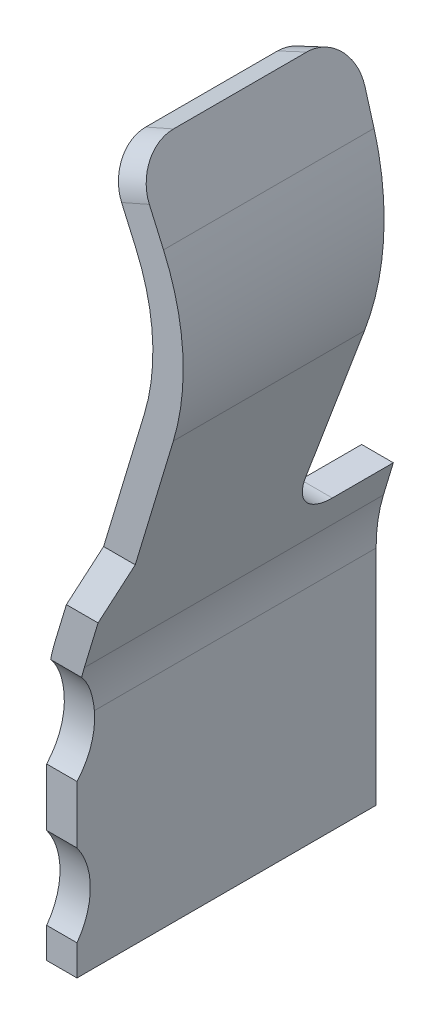
ISO-10303-21;
HEADER;
FILE_DESCRIPTION(('STEP AP214'),'2;1');
FILE_NAME('part.step','',(''),(''),'','','');
FILE_SCHEMA(('AUTOMOTIVE_DESIGN { 1 0 10303 214 1 1 1 1 }'));
ENDSEC;
DATA;
#1=APPLICATION_CONTEXT('core data for automotive mechanical design processes');
#2=APPLICATION_PROTOCOL_DEFINITION('international standard','automotive_design',2000,#1);
#3=PRODUCT_CONTEXT('',#1,'mechanical');
#4=PRODUCT('Part','Part','',(#3));
#5=PRODUCT_RELATED_PRODUCT_CATEGORY('part','',(#4));
#6=PRODUCT_DEFINITION_FORMATION('','',#4);
#7=PRODUCT_DEFINITION_CONTEXT('part definition',#1,'design');
#8=PRODUCT_DEFINITION('design','',#6,#7);
#9=PRODUCT_DEFINITION_SHAPE('','',#8);
#10=(LENGTH_UNIT() NAMED_UNIT(*) SI_UNIT(.MILLI.,.METRE.));
#11=(NAMED_UNIT(*) PLANE_ANGLE_UNIT() SI_UNIT($,.RADIAN.));
#12=(NAMED_UNIT(*) SI_UNIT($,.STERADIAN.) SOLID_ANGLE_UNIT());
#13=UNCERTAINTY_MEASURE_WITH_UNIT(LENGTH_MEASURE(1.E-05),#10,'distance_accuracy_value','');
#14=(GEOMETRIC_REPRESENTATION_CONTEXT(3) GLOBAL_UNCERTAINTY_ASSIGNED_CONTEXT((#13)) GLOBAL_UNIT_ASSIGNED_CONTEXT((#10,
#11,#12)) REPRESENTATION_CONTEXT('',''));
#15=CARTESIAN_POINT('',(0.,0.,0.));
#16=DIRECTION('',(0.,0.,1.));
#17=DIRECTION('',(1.,0.,0.));
#18=AXIS2_PLACEMENT_3D('',#15,#16,#17);
#19=CARTESIAN_POINT('',(-6.93613725867002,3.53312166947706,-0.236832722369338));
#20=DIRECTION('',(-0.914255270392899,-0.402239697454472,0.0483789866630426));
#21=DIRECTION('',(0.402711251685501,-0.915327071470027,0.));
#22=AXIS2_PLACEMENT_3D('',#19,#20,#21);
#23=CYLINDRICAL_SURFACE('',#22,0.2);
#24=CARTESIAN_POINT('',(-6.94964147732528,3.50329761180303,-0.434687053017797));
#25=CARTESIAN_POINT('',(-7.00071840447188,3.6193909515076,-0.448650066039084));
#26=CARTESIAN_POINT('',(-7.03898718351819,3.70637250294574,-0.363398989614743));
#27=CARTESIAN_POINT('',(-7.03898718351819,3.70637250294574,-0.235652283248446));
#28=(BOUNDED_CURVE() B_SPLINE_CURVE(3,(#24,#25,#26,#27),.UNSPECIFIED.,.F.,
.F.) B_SPLINE_CURVE_WITH_KNOTS((4,4),(3.0320715031167,4.71238898038462),
.UNSPECIFIED.) CURVE() GEOMETRIC_REPRESENTATION_ITEM() RATIONAL_B_SPLINE_CURVE((1.,
0.778229742533871,0.778229742533871,1.)) REPRESENTATION_ITEM(''));
#29=CARTESIAN_POINT('',(-6.94964147732528,3.50329761180303,-0.434687053017797));
#30=VERTEX_POINT('',#29);
#31=CARTESIAN_POINT('',(-7.03898718351819,3.70637250294574,-0.235652283248446));
#32=VERTEX_POINT('',#31);
#33=EDGE_CURVE('E342',#30,#32,#28,.T.);
#34=ORIENTED_EDGE('',*,*,#33,.F.);
#35=DIRECTION('',(0.914255270392898,0.402239697454473,-0.0483789866630426));
#36=VECTOR('',#35,1.);
#37=CARTESIAN_POINT('',(-30.997177596038,-7.07676024092296,0.837819069551529));
#38=LINE('',#37,#36);
#39=CARTESIAN_POINT('',(-7.08694053804578,3.44289092405021,-0.427421697659669));
#40=VERTEX_POINT('',#39);
#41=EDGE_CURVE('E11',#40,#30,#38,.T.);
#42=ORIENTED_EDGE('',*,*,#41,.F.);
#43=CARTESIAN_POINT('',(-7.17628624423869,3.64596581519291,-0.228386927890318));
#44=CARTESIAN_POINT('',(-7.17628624423869,3.64596581519291,-0.356133634256616));
#45=CARTESIAN_POINT('',(-7.13801746519237,3.55898426375477,-0.441384710680957));
#46=CARTESIAN_POINT('',(-7.08694053804578,3.44289092405021,-0.427421697659669));
#47=(BOUNDED_CURVE() B_SPLINE_CURVE(3,(#43,#44,#45,#46),.UNSPECIFIED.,.F.,
.F.) B_SPLINE_CURVE_WITH_KNOTS((4,4),(1.57079632679495,3.25111380406287),
.UNSPECIFIED.) CURVE() GEOMETRIC_REPRESENTATION_ITEM() RATIONAL_B_SPLINE_CURVE((1.,
0.778229742533869,0.778229742533869,1.)) REPRESENTATION_ITEM(''));
#48=CARTESIAN_POINT('',(-7.17628624423869,3.64596581519291,-0.228386927890318));
#49=VERTEX_POINT('',#48);
#50=EDGE_CURVE('E349',#49,#40,#47,.T.);
#51=ORIENTED_EDGE('',*,*,#50,.F.);
#52=DIRECTION('',(-0.914255270392898,-0.402239697454473,0.0483789866630426));
#53=VECTOR('',#52,1.);
#54=CARTESIAN_POINT('',(-7.01667950900712,3.71618708377106,-0.236832722369339));
#55=LINE('',#54,#53);
#56=EDGE_CURVE('E292',#32,#49,#55,.T.);
#57=ORIENTED_EDGE('',*,*,#56,.F.);
#58=EDGE_LOOP('',(#34,#42,#51,#57));
#59=FACE_BOUND('',#58,.T.);
#60=ADVANCED_FACE('F16',(#59),#23,.T.);
#61=CARTESIAN_POINT('',(-6.95844493318109,3.52330708865174,0.423604352914838));
#62=DIRECTION('',(0.915327071470027,0.402711251685502,0.));
#63=DIRECTION('',(-0.402711251685502,0.915327071470027,0.));
#64=AXIS2_PLACEMENT_3D('',#61,#62,#63);
#65=CYLINDRICAL_SURFACE('',#64,0.2);
#66=CARTESIAN_POINT('',(-7.09574399390159,3.46290040089891,0.423604352914837));
#67=DIRECTION('',(-0.915327071470027,-0.402711251685502,0.));
#68=DIRECTION('',(-0.402711251685502,0.915327071470027,0.));
#69=AXIS2_PLACEMENT_3D('',#66,#67,#68);
#70=CIRCLE('',#69,0.2);
#71=CARTESIAN_POINT('',(-7.09574399390159,3.46290040089891,0.623604352914837));
#72=VERTEX_POINT('',#71);
#73=CARTESIAN_POINT('',(-7.17628624423869,3.64596581519291,0.423604352914837));
#74=VERTEX_POINT('',#73);
#75=EDGE_CURVE('E291',#72,#74,#70,.T.);
#76=ORIENTED_EDGE('',*,*,#75,.F.);
#77=DIRECTION('',(-0.915327071470027,-0.402711251685503,0.));
#78=VECTOR('',#77,1.);
#79=CARTESIAN_POINT('',(-31.7130633966531,-7.36784176638169,0.623604352914803));
#80=LINE('',#79,#78);
#81=CARTESIAN_POINT('',(-6.95844493318109,3.52330708865174,0.623604352914837));
#82=VERTEX_POINT('',#81);
#83=EDGE_CURVE('E27',#82,#72,#80,.T.);
#84=ORIENTED_EDGE('',*,*,#83,.F.);
#85=CARTESIAN_POINT('',(-6.95844493318109,3.52330708865174,0.423604352914838));
#86=DIRECTION('',(0.915327071470027,0.402711251685502,0.));
#87=DIRECTION('',(0.402711251685502,-0.915327071470027,0.));
#88=AXIS2_PLACEMENT_3D('',#85,#86,#87);
#89=CIRCLE('',#88,0.2);
#90=CARTESIAN_POINT('',(-7.03898718351819,3.70637250294574,0.423604352914837));
#91=VERTEX_POINT('',#90);
#92=EDGE_CURVE('E281',#91,#82,#89,.T.);
#93=ORIENTED_EDGE('',*,*,#92,.F.);
#94=DIRECTION('',(0.915327071470027,0.402711251685503,0.));
#95=VECTOR('',#94,1.);
#96=CARTESIAN_POINT('',(-7.03898718351819,3.70637250294574,0.423604352914837));
#97=LINE('',#96,#95);
#98=EDGE_CURVE('E545',#74,#91,#97,.T.);
#99=ORIENTED_EDGE('',*,*,#98,.F.);
#100=EDGE_LOOP('',(#76,#84,#93,#99));
#101=FACE_BOUND('',#100,.T.);
#102=ADVANCED_FACE('F379',(#101),#65,.T.);
#103=CARTESIAN_POINT('',(-35.81,1.65634067151207,-0.212546111318104));
#104=DIRECTION('',(0.,-1.,0.));
#105=DIRECTION('',(0.,0.,-1.));
#106=AXIS2_PLACEMENT_3D('',#103,#104,#105);
#107=PLANE('',#106);
#108=DIRECTION('',(0.,0.,-1.));
#109=VECTOR('',#108,1.);
#110=CARTESIAN_POINT('',(-7.27150340910558,1.65634067151207,-0.740000000000021));
#111=LINE('',#110,#109);
#112=CARTESIAN_POINT('',(-7.27150340910558,1.65634067151207,-0.438042305987955));
#113=VERTEX_POINT('',#112);
#114=CARTESIAN_POINT('',(-7.27150340910558,1.65634067151207,-0.740000000000021));
#115=VERTEX_POINT('',#114);
#116=EDGE_CURVE('E241',#113,#115,#111,.T.);
#117=ORIENTED_EDGE('',*,*,#116,.F.);
#118=DIRECTION('',(1.,0.,0.));
#119=VECTOR('',#118,1.);
#120=CARTESIAN_POINT('',(-7.11483507894155,1.65634067151207,-0.438042305987954));
#121=LINE('',#120,#119);
#122=CARTESIAN_POINT('',(-7.11483507894154,1.65634067151207,-0.438042305987954));
#123=VERTEX_POINT('',#122);
#124=EDGE_CURVE('E265',#113,#123,#121,.T.);
#125=ORIENTED_EDGE('',*,*,#124,.T.);
#126=DIRECTION('',(0.,0.,1.));
#127=VECTOR('',#126,1.);
#128=CARTESIAN_POINT('',(-7.11483507894154,1.65634067151207,-0.74000000000002));
#129=LINE('',#128,#127);
#130=CARTESIAN_POINT('',(-7.11483507894154,1.65634067151207,-0.74000000000002));
#131=VERTEX_POINT('',#130);
#132=EDGE_CURVE('E504',#131,#123,#129,.T.);
#133=ORIENTED_EDGE('',*,*,#132,.F.);
#134=DIRECTION('',(-1.,0.,0.));
#135=VECTOR('',#134,1.);
#136=CARTESIAN_POINT('',(-6.35,1.65634067151207,-0.740000000000019));
#137=LINE('',#136,#135);
#138=EDGE_CURVE('E1047',#131,#115,#137,.T.);
#139=ORIENTED_EDGE('',*,*,#138,.T.);
#140=EDGE_LOOP('',(#117,#125,#133,#139));
#141=FACE_BOUND('',#140,.T.);
#142=ADVANCED_FACE('F382',(#141),#107,.F.);
#143=CARTESIAN_POINT('',(-35.81,3.70637250294571,-0.459111687165995));
#144=DIRECTION('',(0.,0.119413416546905,0.992844618230162));
#145=DIRECTION('',(1.,0.,0.));
#146=AXIS2_PLACEMENT_3D('',#143,#144,#145);
#147=PLANE('',#146);
#148=DIRECTION('',(0.286748539926818,0.951150986717315,-0.11439875574724));
#149=VECTOR('',#148,1.);
#150=CARTESIAN_POINT('',(-7.14587763511194,1.55337185451571,-0.200161637444148));
#151=LINE('',#150,#149);
#152=CARTESIAN_POINT('',(-7.04733997726959,1.88022335482146,-0.239473382341922));
#153=VERTEX_POINT('',#152);
#154=CARTESIAN_POINT('',(-6.83979823954622,2.56864369924933,-0.322272466749581));
#155=VERTEX_POINT('',#154);
#156=EDGE_CURVE('E248',#153,#155,#151,.T.);
#157=ORIENTED_EDGE('',*,*,#156,.F.);
#158=DIRECTION('',(-1.,0.,0.));
#159=VECTOR('',#158,1.);
#160=CARTESIAN_POINT('',(-7.27150340910559,1.88022335482146,-0.239473382341922));
#161=LINE('',#160,#159);
#162=CARTESIAN_POINT('',(-7.20400830743363,1.88022335482146,-0.239473382341922));
#163=VERTEX_POINT('',#162);
#164=EDGE_CURVE('E245',#153,#163,#161,.T.);
#165=ORIENTED_EDGE('',*,*,#164,.T.);
#166=DIRECTION('',(-0.28674853992682,-0.951150986717314,0.11439875574724));
#167=VECTOR('',#166,1.);
#168=CARTESIAN_POINT('',(-7.28966395488851,1.59610175610151,-0.205300934614505));
#169=LINE('',#168,#167);
#170=CARTESIAN_POINT('',(-6.98341373590366,2.61194022573825,-0.327479914176623));
#171=VERTEX_POINT('',#170);
#172=EDGE_CURVE('E229',#171,#163,#169,.T.);
#173=ORIENTED_EDGE('',*,*,#172,.F.);
#174=CARTESIAN_POINT('',(-7.02552330681659,3.30329498734983,-0.410631932744419));
#175=CARTESIAN_POINT('',(-6.9285450102924,3.08287189317973,-0.384120760424612));
#176=CARTESIAN_POINT('',(-6.91390448882344,2.84250387207174,-0.355210731501567));
#177=CARTESIAN_POINT('',(-6.98341373590366,2.61194022573825,-0.327479914176623));
#178=(BOUNDED_CURVE() B_SPLINE_CURVE(3,(#174,#175,#176,#177),.UNSPECIFIED.,.F.,
.F.) B_SPLINE_CURVE_WITH_KNOTS((4,4),(4.29791199977039,5.00519872138853),
.UNSPECIFIED.) CURVE() GEOMETRIC_REPRESENTATION_ITEM() RATIONAL_B_SPLINE_CURVE((1.,
0.958744787021091,0.958744787021091,1.)) REPRESENTATION_ITEM(''));
#179=CARTESIAN_POINT('',(-7.02552330681659,3.30329498734983,-0.410631932744419));
#180=VERTEX_POINT('',#179);
#181=EDGE_CURVE('E333',#180,#171,#178,.T.);
#182=ORIENTED_EDGE('',*,*,#181,.F.);
#183=DIRECTION('',(0.400292818236851,-0.909830186054405,0.109428936813833));
#184=VECTOR('',#183,1.);
#185=CARTESIAN_POINT('',(-7.03995081965593,3.33608744850051,-0.414576013974334));
#186=LINE('',#185,#184);
#187=EDGE_CURVE('E334',#40,#180,#186,.T.);
#188=ORIENTED_EDGE('',*,*,#187,.F.);
#189=ORIENTED_EDGE('',*,*,#41,.T.);
#190=DIRECTION('',(-0.40029281823685,0.909830186054405,-0.109428936813833));
#191=VECTOR('',#190,1.);
#192=CARTESIAN_POINT('',(-6.90233351008822,3.39577078475993,-0.421754368938235));
#193=LINE('',#192,#191);
#194=CARTESIAN_POINT('',(-6.88822424609609,3.36370167510267,-0.417897288102547));
#195=VERTEX_POINT('',#194);
#196=EDGE_CURVE('E338',#195,#30,#193,.T.);
#197=ORIENTED_EDGE('',*,*,#196,.F.);
#198=CARTESIAN_POINT('',(-6.83979823954622,2.56864369924933,-0.322272466749581));
#199=CARTESIAN_POINT('',(-6.75986260540396,2.83379189253285,-0.354162906673267));
#200=CARTESIAN_POINT('',(-6.77669920509328,3.11021511680704,-0.387409439934769));
#201=CARTESIAN_POINT('',(-6.88822424609609,3.36370167510267,-0.417897288102547));
#202=(BOUNDED_CURVE() B_SPLINE_CURVE(3,(#198,#199,#200,#201),.UNSPECIFIED.,.F.,
.F.) B_SPLINE_CURVE_WITH_KNOTS((4,4),(1.27798658579106,1.98527330740919),
.UNSPECIFIED.) CURVE() GEOMETRIC_REPRESENTATION_ITEM() RATIONAL_B_SPLINE_CURVE((1.,
0.958744787021091,0.958744787021091,1.)) REPRESENTATION_ITEM(''));
#203=EDGE_CURVE('E493',#155,#195,#202,.T.);
#204=ORIENTED_EDGE('',*,*,#203,.F.);
#205=EDGE_LOOP('',(#157,#165,#173,#182,#188,#189,#197,#204));
#206=FACE_BOUND('',#205,.T.);
#207=ADVANCED_FACE('F246',(#206),#147,.F.);
#208=CARTESIAN_POINT('',(-35.81,1.94413292378283,0.623604352914797));
#209=DIRECTION('',(0.,0.,-1.));
#210=DIRECTION('',(0.,-1.,0.));
#211=AXIS2_PLACEMENT_3D('',#208,#209,#210);
#212=PLANE('',#211);
#213=DIRECTION('',(0.4027112516855,-0.915327071470028,0.));
#214=VECTOR('',#213,1.);
#215=CARTESIAN_POINT('',(-6.88822424609609,3.36370167510267,0.623604352914838));
#216=LINE('',#215,#214);
#217=CARTESIAN_POINT('',(-6.88822424609609,3.36370167510267,0.623604352914838));
#218=VERTEX_POINT('',#217);
#219=EDGE_CURVE('E285',#82,#218,#216,.T.);
#220=ORIENTED_EDGE('',*,*,#219,.F.);
#221=ORIENTED_EDGE('',*,*,#83,.T.);
#222=DIRECTION('',(-0.402711251685501,0.915327071470028,0.));
#223=VECTOR('',#222,1.);
#224=CARTESIAN_POINT('',(-7.02552330681659,3.30329498734984,0.623604352914837));
#225=LINE('',#224,#223);
#226=CARTESIAN_POINT('',(-7.02552330681659,3.30329498734983,0.623604352914837));
#227=VERTEX_POINT('',#226);
#228=EDGE_CURVE('E287',#227,#72,#225,.T.);
#229=ORIENTED_EDGE('',*,*,#228,.F.);
#230=CARTESIAN_POINT('',(-7.94085037828662,2.90058373566433,0.623604352914836));
#231=DIRECTION('',(0.,0.,1.));
#232=DIRECTION('',(-1.,0.,0.));
#233=AXIS2_PLACEMENT_3D('',#230,#231,#232);
#234=CIRCLE('',#233,1.);
#235=CARTESIAN_POINT('',(-6.98341373590366,2.61194022573825,0.623604352914837));
#236=VERTEX_POINT('',#235);
#237=EDGE_CURVE('E242',#236,#227,#234,.T.);
#238=ORIENTED_EDGE('',*,*,#237,.F.);
#239=DIRECTION('',(0.28864350992609,0.957436642382956,0.));
#240=VECTOR('',#239,1.);
#241=CARTESIAN_POINT('',(-7.30743664238296,1.53714937485737,0.623604352914836));
#242=LINE('',#241,#240);
#243=CARTESIAN_POINT('',(-7.18474115022836,1.94413292378283,0.623604352914837));
#244=VERTEX_POINT('',#243);
#245=EDGE_CURVE('E539',#244,#236,#242,.T.);
#246=ORIENTED_EDGE('',*,*,#245,.F.);
#247=DIRECTION('',(1.,0.,0.));
#248=VECTOR('',#247,1.);
#249=CARTESIAN_POINT('',(-35.81,1.94413292378283,0.623604352914797));
#250=LINE('',#249,#248);
#251=CARTESIAN_POINT('',(-7.02807282006433,1.94413292378283,0.623604352914837));
#252=VERTEX_POINT('',#251);
#253=EDGE_CURVE('E337',#244,#252,#250,.T.);
#254=ORIENTED_EDGE('',*,*,#253,.T.);
#255=DIRECTION('',(-0.288643509926088,-0.957436642382956,0.));
#256=VECTOR('',#255,1.);
#257=CARTESIAN_POINT('',(-7.16382114602552,1.49385284836845,0.623604352914837));
#258=LINE('',#257,#256);
#259=CARTESIAN_POINT('',(-6.83979823954622,2.56864369924933,0.623604352914837));
#260=VERTEX_POINT('',#259);
#261=EDGE_CURVE('E521',#260,#252,#258,.T.);
#262=ORIENTED_EDGE('',*,*,#261,.F.);
#263=CARTESIAN_POINT('',(-7.94085037828662,2.90058373566433,0.623604352914836));
#264=DIRECTION('',(0.,0.,-1.));
#265=DIRECTION('',(-1.,0.,0.));
#266=AXIS2_PLACEMENT_3D('',#263,#264,#265);
#267=CIRCLE('',#266,1.15);
#268=EDGE_CURVE('E343',#218,#260,#267,.T.);
#269=ORIENTED_EDGE('',*,*,#268,.F.);
#270=EDGE_LOOP('',(#220,#221,#229,#238,#246,#254,#262,#269));
#271=FACE_BOUND('',#270,.T.);
#272=ADVANCED_FACE('F393',(#271),#212,.F.);
#273=CARTESIAN_POINT('',(-35.81,1.7003498353216,0.749999999999972));
#274=DIRECTION('',(0.,-0.460287319631494,-0.887770005906065));
#275=DIRECTION('',(0.,-0.887770005906065,0.460287319631494));
#276=AXIS2_PLACEMENT_3D('',#273,#274,#275);
#277=PLANE('',#276);
#278=ORIENTED_EDGE('',*,*,#253,.F.);
#279=DIRECTION('',(0.258541028225373,0.857586072334425,-0.444637678635293));
#280=VECTOR('',#279,1.);
#281=CARTESIAN_POINT('',(-7.12642343830644,2.13757401070795,0.523309818502746));
#282=LINE('',#281,#280);
#283=CARTESIAN_POINT('',(-7.25242108767926,1.7196371362757,0.73999999999998));
#284=VERTEX_POINT('',#283);
#285=EDGE_CURVE('E328',#284,#244,#282,.T.);
#286=ORIENTED_EDGE('',*,*,#285,.F.);
#287=DIRECTION('',(-1.,0.,0.));
#288=VECTOR('',#287,1.);
#289=CARTESIAN_POINT('',(-6.35,1.7196371362757,0.739999999999981));
#290=LINE('',#289,#288);
#291=CARTESIAN_POINT('',(-7.09575275751523,1.7196371362757,0.73999999999998));
#292=VERTEX_POINT('',#291);
#293=EDGE_CURVE('E318',#292,#284,#290,.T.);
#294=ORIENTED_EDGE('',*,*,#293,.F.);
#295=DIRECTION('',(-0.258541028225372,-0.857586072334425,0.444637678635293));
#296=VECTOR('',#295,1.);
#297=CARTESIAN_POINT('',(-6.98022736191621,2.10283732290249,0.541319952677682));
#298=LINE('',#297,#296);
#299=EDGE_CURVE('E498',#252,#292,#298,.T.);
#300=ORIENTED_EDGE('',*,*,#299,.F.);
#301=EDGE_LOOP('',(#278,#286,#294,#300));
#302=FACE_BOUND('',#301,.T.);
#303=ADVANCED_FACE('F396',(#302),#277,.F.);
#304=CARTESIAN_POINT('',(-6.35,1.24850586493128,0.739999999999981));
#305=DIRECTION('',(0.,0.,-1.));
#306=DIRECTION('',(0.,-1.,0.));
#307=AXIS2_PLACEMENT_3D('',#304,#305,#306);
#308=PLANE('',#307);
#309=DIRECTION('',(0.,1.,0.));
#310=VECTOR('',#309,1.);
#311=CARTESIAN_POINT('',(-7.2,0.145965815192914,0.73999999999998));
#312=LINE('',#311,#310);
#313=CARTESIAN_POINT('',(-7.2,0.145965815192914,0.73999999999998));
#314=VERTEX_POINT('',#313);
#315=CARTESIAN_POINT('',(-7.2,0.296740599868486,0.73999999999998));
#316=VERTEX_POINT('',#315);
#317=EDGE_CURVE('E450',#314,#316,#312,.T.);
#318=ORIENTED_EDGE('',*,*,#317,.T.);
#319=DIRECTION('',(-1.,0.,0.));
#320=VECTOR('',#319,1.);
#321=CARTESIAN_POINT('',(-35.81,0.296740599868486,0.73999999999994));
#322=LINE('',#321,#320);
#323=CARTESIAN_POINT('',(-7.35,0.296740599868486,0.739999999999979));
#324=VERTEX_POINT('',#323);
#325=EDGE_CURVE('E273',#316,#324,#322,.T.);
#326=ORIENTED_EDGE('',*,*,#325,.T.);
#327=DIRECTION('',(0.,-1.,0.));
#328=VECTOR('',#327,1.);
#329=CARTESIAN_POINT('',(-7.35,0.145965815192914,0.739999999999979));
#330=LINE('',#329,#328);
#331=CARTESIAN_POINT('',(-7.35,0.145965815192914,0.739999999999979));
#332=VERTEX_POINT('',#331);
#333=EDGE_CURVE('E322',#324,#332,#330,.T.);
#334=ORIENTED_EDGE('',*,*,#333,.T.);
#335=DIRECTION('',(1.,0.,0.));
#336=VECTOR('',#335,1.);
#337=CARTESIAN_POINT('',(-7.2,0.145965815192914,0.73999999999998));
#338=LINE('',#337,#336);
#339=EDGE_CURVE('E513',#332,#314,#338,.T.);
#340=ORIENTED_EDGE('',*,*,#339,.T.);
#341=EDGE_LOOP('',(#318,#326,#334,#340));
#342=FACE_BOUND('',#341,.T.);
#343=ADVANCED_FACE('F606',(#342),#308,.F.);
#344=CARTESIAN_POINT('',(-6.35,1.24850586493128,-0.740000000000019));
#345=DIRECTION('',(0.,0.,-1.));
#346=DIRECTION('',(0.,-1.,0.));
#347=AXIS2_PLACEMENT_3D('',#344,#345,#346);
#348=PLANE('',#347);
#349=ORIENTED_EDGE('',*,*,#138,.F.);
#350=DIRECTION('',(0.288643509926088,0.957436642382956,0.));
#351=VECTOR('',#350,1.);
#352=CARTESIAN_POINT('',(-7.16382114602551,1.49385284836845,-0.74000000000002));
#353=LINE('',#352,#351);
#354=CARTESIAN_POINT('',(-7.16382114602551,1.49385284836845,-0.74000000000002));
#355=VERTEX_POINT('',#354);
#356=EDGE_CURVE('E190',#355,#131,#353,.T.);
#357=ORIENTED_EDGE('',*,*,#356,.F.);
#358=CARTESIAN_POINT('',(-6.35,1.24850586493128,-0.740000000000019));
#359=DIRECTION('',(0.,0.,-1.));
#360=DIRECTION('',(1.,0.,0.));
#361=AXIS2_PLACEMENT_3D('',#358,#359,#360);
#362=CIRCLE('',#361,0.85);
#363=CARTESIAN_POINT('',(-7.2,1.24850586493128,-0.74000000000002));
#364=VERTEX_POINT('',#363);
#365=EDGE_CURVE('E200',#364,#355,#362,.T.);
#366=ORIENTED_EDGE('',*,*,#365,.F.);
#367=DIRECTION('',(0.,1.,0.));
#368=VECTOR('',#367,1.);
#369=CARTESIAN_POINT('',(-7.2,0.145965815192914,-0.74000000000002));
#370=LINE('',#369,#368);
#371=CARTESIAN_POINT('',(-7.2,0.145965815192914,-0.74000000000002));
#372=VERTEX_POINT('',#371);
#373=EDGE_CURVE('E516',#372,#364,#370,.T.);
#374=ORIENTED_EDGE('',*,*,#373,.F.);
#375=DIRECTION('',(1.,0.,0.));
#376=VECTOR('',#375,1.);
#377=CARTESIAN_POINT('',(-7.2,0.145965815192914,-0.74000000000002));
#378=LINE('',#377,#376);
#379=CARTESIAN_POINT('',(-7.35,0.145965815192914,-0.740000000000021));
#380=VERTEX_POINT('',#379);
#381=EDGE_CURVE('E1090',#380,#372,#378,.T.);
#382=ORIENTED_EDGE('',*,*,#381,.F.);
#383=DIRECTION('',(0.,-1.,0.));
#384=VECTOR('',#383,1.);
#385=CARTESIAN_POINT('',(-7.35,0.145965815192914,-0.740000000000021));
#386=LINE('',#385,#384);
#387=CARTESIAN_POINT('',(-7.35,1.24850586493128,-0.740000000000021));
#388=VERTEX_POINT('',#387);
#389=EDGE_CURVE('E42',#388,#380,#386,.T.);
#390=ORIENTED_EDGE('',*,*,#389,.F.);
#391=CARTESIAN_POINT('',(-6.35,1.24850586493128,-0.740000000000019));
#392=DIRECTION('',(0.,0.,1.));
#393=DIRECTION('',(1.,0.,0.));
#394=AXIS2_PLACEMENT_3D('',#391,#392,#393);
#395=CIRCLE('',#394,1.);
#396=CARTESIAN_POINT('',(-7.30743664238296,1.53714937485737,-0.740000000000021));
#397=VERTEX_POINT('',#396);
#398=EDGE_CURVE('E323',#397,#388,#395,.T.);
#399=ORIENTED_EDGE('',*,*,#398,.F.);
#400=DIRECTION('',(-0.28864350992609,-0.957436642382956,0.));
#401=VECTOR('',#400,1.);
#402=CARTESIAN_POINT('',(-7.30743664238296,1.53714937485737,-0.740000000000021));
#403=LINE('',#402,#401);
#404=EDGE_CURVE('E296',#115,#397,#403,.T.);
#405=ORIENTED_EDGE('',*,*,#404,.F.);
#406=EDGE_LOOP('',(#349,#357,#366,#374,#382,#390,#399,#405));
#407=FACE_BOUND('',#406,.T.);
#408=ADVANCED_FACE('F698',(#407),#348,.T.);
#409=CARTESIAN_POINT('',(-7.35,0.145965815192914,-0.740000000000021));
#410=DIRECTION('',(1.,0.,0.));
#411=DIRECTION('',(0.,1.,0.));
#412=AXIS2_PLACEMENT_3D('',#409,#410,#411);
#413=PLANE('',#412);
#414=DIRECTION('',(0.,-1.,0.));
#415=VECTOR('',#414,1.);
#416=CARTESIAN_POINT('',(-7.35,0.145965815192914,0.739999999999979));
#417=LINE('',#416,#415);
#418=CARTESIAN_POINT('',(-7.35,0.988055123608201,0.739999999999979));
#419=VERTEX_POINT('',#418);
#420=CARTESIAN_POINT('',(-7.35,0.703259400131467,0.739999999999979));
#421=VERTEX_POINT('',#420);
#422=EDGE_CURVE('E490',#419,#421,#417,.T.);
#423=ORIENTED_EDGE('',*,*,#422,.F.);
#424=CARTESIAN_POINT('',(-7.35,1.21669179396546,0.995153761033096));
#425=DIRECTION('',(1.,0.,0.));
#426=DIRECTION('',(0.,1.,0.));
#427=AXIS2_PLACEMENT_3D('',#424,#425,#426);
#428=CIRCLE('',#427,0.342604974863759);
#429=CARTESIAN_POINT('',(-7.35,1.24850586493128,0.654029100989324));
#430=VERTEX_POINT('',#429);
#431=EDGE_CURVE('E253',#419,#430,#428,.T.);
#432=ORIENTED_EDGE('',*,*,#431,.T.);
#433=DIRECTION('',(0.,0.,1.));
#434=VECTOR('',#433,1.);
#435=CARTESIAN_POINT('',(-7.35,1.24850586493128,-0.740000000000021));
#436=LINE('',#435,#434);
#437=EDGE_CURVE('E569',#388,#430,#436,.T.);
#438=ORIENTED_EDGE('',*,*,#437,.F.);
#439=ORIENTED_EDGE('',*,*,#389,.T.);
#440=DIRECTION('',(0.,0.,1.));
#441=VECTOR('',#440,1.);
#442=CARTESIAN_POINT('',(-7.35,0.145965815192914,-0.740000000000021));
#443=LINE('',#442,#441);
#444=EDGE_CURVE('E271',#380,#332,#443,.T.);
#445=ORIENTED_EDGE('',*,*,#444,.T.);
#446=ORIENTED_EDGE('',*,*,#333,.F.);
#447=CARTESIAN_POINT('',(-7.35,0.499999999999977,1.0194268345702));
#448=DIRECTION('',(1.,0.,0.));
#449=DIRECTION('',(0.,1.,0.));
#450=AXIS2_PLACEMENT_3D('',#447,#448,#449);
#451=CIRCLE('',#450,0.345533991988848);
#452=EDGE_CURVE('E280',#324,#421,#451,.T.);
#453=ORIENTED_EDGE('',*,*,#452,.T.);
#454=EDGE_LOOP('',(#423,#432,#438,#439,#445,#446,#453));
#455=FACE_BOUND('',#454,.T.);
#456=ADVANCED_FACE('F376',(#455),#413,.F.);
#457=CARTESIAN_POINT('',(-6.35,1.24850586493128,-0.740000000000019));
#458=DIRECTION('',(0.,0.,1.));
#459=DIRECTION('',(-1.,0.,0.));
#460=AXIS2_PLACEMENT_3D('',#457,#458,#459);
#461=CYLINDRICAL_SURFACE('',#460,1.);
#462=ORIENTED_EDGE('',*,*,#437,.T.);
#463=CARTESIAN_POINT('',(-7.35,1.24850586493127,0.654029100989324));
#464=CARTESIAN_POINT('',(-7.35000007407363,1.25306932177748,0.654454497923835));
#465=CARTESIAN_POINT('',(-7.34996876472137,1.25762446546712,0.654969794425774));
#466=CARTESIAN_POINT('',(-7.34984483490432,1.26669234380872,0.656178662703507));
#467=CARTESIAN_POINT('',(-7.34975245079703,1.27120517419842,0.656871540938563));
#468=CARTESIAN_POINT('',(-7.34950808670678,1.28018764830056,0.658435530000101));
#469=CARTESIAN_POINT('',(-7.34935624289613,1.28465736694881,0.659306231418194));
#470=CARTESIAN_POINT('',(-7.34899477703104,1.29355289226453,0.661225514697385));
#471=CARTESIAN_POINT('',(-7.34878519445909,1.29797872680563,0.66227397481712));
#472=CARTESIAN_POINT('',(-7.34831002792707,1.30678583476397,0.664548502475786));
#473=CARTESIAN_POINT('',(-7.34804439252603,1.31116706334694,0.665774732832754));
#474=CARTESIAN_POINT('',(-7.34745889152881,1.31988437499395,0.668404514864849));
#475=CARTESIAN_POINT('',(-7.34713889099457,1.32422031651338,0.669808505488944));
#476=CARTESIAN_POINT('',(-7.34644641069623,1.33284654509273,0.672793524574298));
#477=CARTESIAN_POINT('',(-7.34607372137307,1.33713657245114,0.67437525453736));
#478=CARTESIAN_POINT('',(-7.34527760241854,1.34567049059148,0.677715533217567));
#479=CARTESIAN_POINT('',(-7.34485389867301,1.34991398511754,0.679475028174295));
#480=CARTESIAN_POINT('',(-7.34396321849389,1.35830019523904,0.683146652073494));
#481=CARTESIAN_POINT('',(-7.34349650719558,1.36244335249443,0.6850578369075));
#482=CARTESIAN_POINT('',(-7.34252312860201,1.37063194178074,0.689033531510101));
#483=CARTESIAN_POINT('',(-7.34201661211662,1.3746776733665,0.691097460992356));
#484=CARTESIAN_POINT('',(-7.34096713168236,1.38267128376232,0.695378434355306));
#485=CARTESIAN_POINT('',(-7.34042424735263,1.3866193519919,0.697595144046891));
#486=CARTESIAN_POINT('',(-7.33930544298223,1.39441764648526,0.702181418874192));
#487=CARTESIAN_POINT('',(-7.33872954299439,1.39826793013232,0.704550891332612));
#488=CARTESIAN_POINT('',(-7.33754802962805,1.40587073759695,0.709442454924468));
#489=CARTESIAN_POINT('',(-7.33694238918283,1.40962316741917,0.71196468558873));
#490=CARTESIAN_POINT('',(-7.33570462073635,1.4170304504751,0.717161525963166));
#491=CARTESIAN_POINT('',(-7.33507243147301,1.42068504210779,0.719836493879692));
#492=CARTESIAN_POINT('',(-7.33378470654221,1.42789683764576,0.725338623347789));
#493=CARTESIAN_POINT('',(-7.33312908847075,1.43145359950846,0.728166344681211));
#494=CARTESIAN_POINT('',(-7.33179751594577,1.43847023752972,0.733973670299353));
#495=CARTESIAN_POINT('',(-7.33112147050096,1.44192948379825,0.736954014976151));
#496=CARTESIAN_POINT('',(-7.33043911813473,1.44532846432271,0.73999999999998));
#497=B_SPLINE_CURVE_WITH_KNOTS('',3,(#463,#464,#465,#466,#467,#468,#469,#470,#471,#472,#473,
#474,#475,#476,#477,#478,#479,#480,#481,#482,#483,#484,#485,#486,#487,#488,#489,#490,#491,#492,
#493,#494,#495,#496),.UNSPECIFIED.,.F.,.F.,(4,2,2,2,2,2,2,2,2,2,2,2,2,2,2,2,4),(0.,
0.013748827736232,0.0274447569667543,0.0411095020469267,0.0547649260984996,0.0684329369744623,
0.0821353821572885,0.0958939450956067,0.109730045405059,0.123485924962942,0.137191991355335,
0.150868974599206,0.164537737053089,0.17821917870054,0.191934141578146,0.205703315519925,
0.219547147320743),.UNSPECIFIED.);
#498=CARTESIAN_POINT('',(-7.33043911813473,1.44532846432271,0.739999999999979));
#499=VERTEX_POINT('',#498);
#500=EDGE_CURVE('E359',#430,#499,#497,.T.);
#501=ORIENTED_EDGE('',*,*,#500,.T.);
#502=CARTESIAN_POINT('',(-6.35,1.24850586493128,0.739999999999981));
#503=DIRECTION('',(0.,0.,1.));
#504=DIRECTION('',(1.,0.,0.));
#505=AXIS2_PLACEMENT_3D('',#502,#503,#504);
#506=CIRCLE('',#505,1.);
#507=CARTESIAN_POINT('',(-7.30743664238296,1.53714937485737,0.739999999999979));
#508=VERTEX_POINT('',#507);
#509=EDGE_CURVE('E443',#508,#499,#506,.T.);
#510=ORIENTED_EDGE('',*,*,#509,.F.);
#511=DIRECTION('',(0.,0.,1.));
#512=VECTOR('',#511,1.);
#513=CARTESIAN_POINT('',(-7.30743664238296,1.53714937485737,-0.740000000000021));
#514=LINE('',#513,#512);
#515=EDGE_CURVE('E324',#397,#508,#514,.T.);
#516=ORIENTED_EDGE('',*,*,#515,.F.);
#517=ORIENTED_EDGE('',*,*,#398,.T.);
#518=EDGE_LOOP('',(#462,#501,#510,#516,#517));
#519=FACE_BOUND('',#518,.T.);
#520=ADVANCED_FACE('F366',(#519),#461,.T.);
#521=CARTESIAN_POINT('',(-7.30743664238296,1.53714937485737,-0.740000000000021));
#522=DIRECTION('',(0.957436642382956,-0.28864350992609,0.));
#523=DIRECTION('',(0.,0.,-1.));
#524=AXIS2_PLACEMENT_3D('',#521,#522,#523);
#525=PLANE('',#524);
#526=ORIENTED_EDGE('',*,*,#172,.T.);
#527=CARTESIAN_POINT('',(-7.20400830743363,1.88022335482146,-0.239473382341922));
#528=CARTESIAN_POINT('',(-7.20639827429864,1.87229578405696,-0.238519901512672));
#529=CARTESIAN_POINT('',(-7.20880115558452,1.86432537588468,-0.238042305987954));
#530=CARTESIAN_POINT('',(-7.21120834682184,1.85634067151208,-0.238042305987954));
#531=(BOUNDED_CURVE() B_SPLINE_CURVE(3,(#527,#528,#529,#530),.UNSPECIFIED.,.F.,
.F.) B_SPLINE_CURVE_WITH_KNOTS((4,4),(4.59268992994791,4.71238898038469),
.UNSPECIFIED.) CURVE() GEOMETRIC_REPRESENTATION_ITEM() RATIONAL_B_SPLINE_CURVE((1.,
0.998806367803328,0.998806367803328,1.)) REPRESENTATION_ITEM(''));
#532=CARTESIAN_POINT('',(-7.21120834682184,1.85634067151208,-0.238042305987954));
#533=VERTEX_POINT('',#532);
#534=EDGE_CURVE('E234',#163,#533,#531,.T.);
#535=ORIENTED_EDGE('',*,*,#534,.T.);
#536=CARTESIAN_POINT('',(-7.21120834682184,1.85634067151208,-0.238042305987954));
#537=CARTESIAN_POINT('',(-7.24652837656353,1.73918338398669,-0.238042305987954));
#538=CARTESIAN_POINT('',(-7.27150340910558,1.65634067151208,-0.320885018462573));
#539=CARTESIAN_POINT('',(-7.27150340910558,1.65634067151207,-0.438042305987955));
#540=(BOUNDED_CURVE() B_SPLINE_CURVE(3,(#536,#537,#538,#539),.UNSPECIFIED.,.F.,
.F.) B_SPLINE_CURVE_WITH_KNOTS((4,4),(4.71238898038469,6.28318530717959),
.UNSPECIFIED.) CURVE() GEOMETRIC_REPRESENTATION_ITEM() RATIONAL_B_SPLINE_CURVE((1.,
0.804737854124365,0.804737854124365,1.)) REPRESENTATION_ITEM(''));
#541=EDGE_CURVE('E257',#533,#113,#540,.T.);
#542=ORIENTED_EDGE('',*,*,#541,.T.);
#543=ORIENTED_EDGE('',*,*,#116,.T.);
#544=ORIENTED_EDGE('',*,*,#404,.T.);
#545=ORIENTED_EDGE('',*,*,#515,.T.);
#546=DIRECTION('',(-0.28864350992609,-0.957436642382956,0.));
#547=VECTOR('',#546,1.);
#548=CARTESIAN_POINT('',(-7.30743664238296,1.53714937485737,0.739999999999979));
#549=LINE('',#548,#547);
#550=EDGE_CURVE('E352',#284,#508,#549,.T.);
#551=ORIENTED_EDGE('',*,*,#550,.F.);
#552=ORIENTED_EDGE('',*,*,#285,.T.);
#553=ORIENTED_EDGE('',*,*,#245,.T.);
#554=DIRECTION('',(0.,0.,1.));
#555=VECTOR('',#554,1.);
#556=CARTESIAN_POINT('',(-6.98341373590366,2.61194022573825,-0.74000000000002));
#557=LINE('',#556,#555);
#558=EDGE_CURVE('E237',#171,#236,#557,.T.);
#559=ORIENTED_EDGE('',*,*,#558,.F.);
#560=EDGE_LOOP('',(#526,#535,#542,#543,#544,#545,#551,#552,#553,#559));
#561=FACE_BOUND('',#560,.T.);
#562=ADVANCED_FACE('F231',(#561),#525,.F.);
#563=CARTESIAN_POINT('',(-7.94085037828662,2.90058373566433,-0.740000000000021));
#564=DIRECTION('',(0.,0.,1.));
#565=DIRECTION('',(-1.,0.,0.));
#566=AXIS2_PLACEMENT_3D('',#563,#564,#565);
#567=CYLINDRICAL_SURFACE('',#566,1.);
#568=DIRECTION('',(0.,0.,1.));
#569=VECTOR('',#568,1.);
#570=CARTESIAN_POINT('',(-7.02552330681659,3.30329498734983,-0.74000000000002));
#571=LINE('',#570,#569);
#572=EDGE_CURVE('E329',#180,#227,#571,.T.);
#573=ORIENTED_EDGE('',*,*,#572,.F.);
#574=ORIENTED_EDGE('',*,*,#181,.T.);
#575=ORIENTED_EDGE('',*,*,#558,.T.);
#576=ORIENTED_EDGE('',*,*,#237,.T.);
#577=EDGE_LOOP('',(#573,#574,#575,#576));
#578=FACE_BOUND('',#577,.T.);
#579=ADVANCED_FACE('F404',(#578),#567,.F.);
#580=CARTESIAN_POINT('',(-7.02552330681659,3.30329498734984,-0.74000000000002));
#581=DIRECTION('',(0.915327071470028,0.402711251685501,0.));
#582=DIRECTION('',(0.,0.,-1.));
#583=AXIS2_PLACEMENT_3D('',#580,#581,#582);
#584=PLANE('',#583);
#585=ORIENTED_EDGE('',*,*,#228,.T.);
#586=ORIENTED_EDGE('',*,*,#75,.T.);
#587=DIRECTION('',(0.,0.,1.));
#588=VECTOR('',#587,1.);
#589=CARTESIAN_POINT('',(-7.17628624423869,3.64596581519291,-0.740000000000021));
#590=LINE('',#589,#588);
#591=EDGE_CURVE('E541',#49,#74,#590,.T.);
#592=ORIENTED_EDGE('',*,*,#591,.F.);
#593=ORIENTED_EDGE('',*,*,#50,.T.);
#594=ORIENTED_EDGE('',*,*,#187,.T.);
#595=ORIENTED_EDGE('',*,*,#572,.T.);
#596=EDGE_LOOP('',(#585,#586,#592,#593,#594,#595));
#597=FACE_BOUND('',#596,.T.);
#598=ADVANCED_FACE('F407',(#597),#584,.F.);
#599=CARTESIAN_POINT('',(-7.03898718351819,3.70637250294574,-0.74000000000002));
#600=DIRECTION('',(0.402711251685503,-0.915327071470027,0.));
#601=DIRECTION('',(0.,0.,-1.));
#602=AXIS2_PLACEMENT_3D('',#599,#600,#601);
#603=PLANE('',#602);
#604=ORIENTED_EDGE('',*,*,#591,.T.);
#605=ORIENTED_EDGE('',*,*,#98,.T.);
#606=DIRECTION('',(0.,0.,1.));
#607=VECTOR('',#606,1.);
#608=CARTESIAN_POINT('',(-7.03898718351819,3.70637250294574,-0.74000000000002));
#609=LINE('',#608,#607);
#610=EDGE_CURVE('E286',#32,#91,#609,.T.);
#611=ORIENTED_EDGE('',*,*,#610,.F.);
#612=ORIENTED_EDGE('',*,*,#56,.T.);
#613=EDGE_LOOP('',(#604,#605,#611,#612));
#614=FACE_BOUND('',#613,.T.);
#615=ADVANCED_FACE('F377',(#614),#603,.F.);
#616=CARTESIAN_POINT('',(-6.88822424609608,3.36370167510267,-0.74000000000002));
#617=DIRECTION('',(-0.915327071470028,-0.4027112516855,0.));
#618=DIRECTION('',(-0.4027112516855,0.915327071470028,0.));
#619=AXIS2_PLACEMENT_3D('',#616,#617,#618);
#620=PLANE('',#619);
#621=ORIENTED_EDGE('',*,*,#610,.T.);
#622=ORIENTED_EDGE('',*,*,#92,.T.);
#623=ORIENTED_EDGE('',*,*,#219,.T.);
#624=DIRECTION('',(0.,0.,1.));
#625=VECTOR('',#624,1.);
#626=CARTESIAN_POINT('',(-6.88822424609608,3.36370167510267,-0.74000000000002));
#627=LINE('',#626,#625);
#628=EDGE_CURVE('E346',#195,#218,#627,.T.);
#629=ORIENTED_EDGE('',*,*,#628,.F.);
#630=ORIENTED_EDGE('',*,*,#196,.T.);
#631=ORIENTED_EDGE('',*,*,#33,.T.);
#632=EDGE_LOOP('',(#621,#622,#623,#629,#630,#631));
#633=FACE_BOUND('',#632,.T.);
#634=ADVANCED_FACE('F660',(#633),#620,.F.);
#635=CARTESIAN_POINT('',(-7.94085037828662,2.90058373566433,-0.740000000000021));
#636=DIRECTION('',(0.,0.,1.));
#637=DIRECTION('',(-1.,0.,0.));
#638=AXIS2_PLACEMENT_3D('',#635,#636,#637);
#639=CYLINDRICAL_SURFACE('',#638,1.15);
#640=DIRECTION('',(0.,0.,1.));
#641=VECTOR('',#640,1.);
#642=CARTESIAN_POINT('',(-6.83979823954622,2.56864369924933,-0.74000000000002));
#643=LINE('',#642,#641);
#644=EDGE_CURVE('E517',#155,#260,#643,.T.);
#645=ORIENTED_EDGE('',*,*,#644,.F.);
#646=ORIENTED_EDGE('',*,*,#203,.T.);
#647=ORIENTED_EDGE('',*,*,#628,.T.);
#648=ORIENTED_EDGE('',*,*,#268,.T.);
#649=EDGE_LOOP('',(#645,#646,#647,#648));
#650=FACE_BOUND('',#649,.T.);
#651=ADVANCED_FACE('F402',(#650),#639,.T.);
#652=CARTESIAN_POINT('',(-7.16382114602551,1.49385284836845,-0.74000000000002));
#653=DIRECTION('',(-0.957436642382956,0.288643509926088,0.));
#654=DIRECTION('',(0.,0.,1.));
#655=AXIS2_PLACEMENT_3D('',#652,#653,#654);
#656=PLANE('',#655);
#657=ORIENTED_EDGE('',*,*,#356,.T.);
#658=ORIENTED_EDGE('',*,*,#132,.T.);
#659=CARTESIAN_POINT('',(-7.11483507894154,1.65634067151207,-0.438042305987954));
#660=CARTESIAN_POINT('',(-7.11483507894155,1.65634067151208,-0.320885018462573));
#661=CARTESIAN_POINT('',(-7.0898600463995,1.73918338398669,-0.238042305987954));
#662=CARTESIAN_POINT('',(-7.0545400166578,1.85634067151208,-0.238042305987954));
#663=(BOUNDED_CURVE() B_SPLINE_CURVE(3,(#659,#660,#661,#662),.UNSPECIFIED.,.F.,
.F.) B_SPLINE_CURVE_WITH_KNOTS((4,4),(0.,1.5707963267949),
.UNSPECIFIED.) CURVE() GEOMETRIC_REPRESENTATION_ITEM() RATIONAL_B_SPLINE_CURVE((1.,
0.804737854124365,0.804737854124365,1.)) REPRESENTATION_ITEM(''));
#664=CARTESIAN_POINT('',(-7.0545400166578,1.85634067151208,-0.238042305987954));
#665=VERTEX_POINT('',#664);
#666=EDGE_CURVE('E297',#123,#665,#663,.T.);
#667=ORIENTED_EDGE('',*,*,#666,.T.);
#668=CARTESIAN_POINT('',(-7.0545400166578,1.85634067151208,-0.238042305987954));
#669=CARTESIAN_POINT('',(-7.05213282542048,1.86432537588468,-0.238042305987954));
#670=CARTESIAN_POINT('',(-7.04972994413461,1.87229578405696,-0.238519901512672));
#671=CARTESIAN_POINT('',(-7.04733997726959,1.88022335482146,-0.239473382341922));
#672=(BOUNDED_CURVE() B_SPLINE_CURVE(3,(#668,#669,#670,#671),.UNSPECIFIED.,.F.,
.F.) B_SPLINE_CURVE_WITH_KNOTS((4,4),(1.5707963267949,1.69049537723168),
.UNSPECIFIED.) CURVE() GEOMETRIC_REPRESENTATION_ITEM() RATIONAL_B_SPLINE_CURVE((1.,
0.998806367803328,0.998806367803328,1.)) REPRESENTATION_ITEM(''));
#673=EDGE_CURVE('E303',#665,#153,#672,.T.);
#674=ORIENTED_EDGE('',*,*,#673,.T.);
#675=ORIENTED_EDGE('',*,*,#156,.T.);
#676=ORIENTED_EDGE('',*,*,#644,.T.);
#677=ORIENTED_EDGE('',*,*,#261,.T.);
#678=ORIENTED_EDGE('',*,*,#299,.T.);
#679=DIRECTION('',(0.288643509926088,0.957436642382956,0.));
#680=VECTOR('',#679,1.);
#681=CARTESIAN_POINT('',(-7.16382114602552,1.49385284836845,0.73999999999998));
#682=LINE('',#681,#680);
#683=CARTESIAN_POINT('',(-7.16382114602552,1.49385284836845,0.73999999999998));
#684=VERTEX_POINT('',#683);
#685=EDGE_CURVE('E311',#684,#292,#682,.T.);
#686=ORIENTED_EDGE('',*,*,#685,.F.);
#687=DIRECTION('',(0.,0.,1.));
#688=VECTOR('',#687,1.);
#689=CARTESIAN_POINT('',(-7.16382114602551,1.49385284836845,-0.74000000000002));
#690=LINE('',#689,#688);
#691=EDGE_CURVE('E505',#355,#684,#690,.T.);
#692=ORIENTED_EDGE('',*,*,#691,.F.);
#693=EDGE_LOOP('',(#657,#658,#667,#674,#675,#676,#677,#678,#686,#692));
#694=FACE_BOUND('',#693,.T.);
#695=ADVANCED_FACE('F398',(#694),#656,.F.);
#696=CARTESIAN_POINT('',(-6.35,1.24850586493128,-0.740000000000019));
#697=DIRECTION('',(0.,0.,1.));
#698=DIRECTION('',(-1.,0.,0.));
#699=AXIS2_PLACEMENT_3D('',#696,#697,#698);
#700=CYLINDRICAL_SURFACE('',#699,0.85);
#701=CARTESIAN_POINT('',(-6.35,1.24850586493128,0.739999999999981));
#702=DIRECTION('',(0.,0.,-1.));
#703=DIRECTION('',(1.,0.,0.));
#704=AXIS2_PLACEMENT_3D('',#701,#702,#703);
#705=CIRCLE('',#704,0.85);
#706=CARTESIAN_POINT('',(-7.17689833980291,1.44532846432271,0.73999999999998));
#707=VERTEX_POINT('',#706);
#708=EDGE_CURVE('E433',#707,#684,#705,.T.);
#709=ORIENTED_EDGE('',*,*,#708,.F.);
#710=CARTESIAN_POINT('',(-7.17689833980291,1.44532846432271,0.73999999999998));
#711=CARTESIAN_POINT('',(-7.17770626403919,1.44193422770681,0.736958271492977));
#712=CARTESIAN_POINT('',(-7.17850646911214,1.43847955797032,0.733981716742078));
#713=CARTESIAN_POINT('',(-7.18008202543596,1.43147212175921,0.728181521052563));
#714=CARTESIAN_POINT('',(-7.18085749045514,1.42792001022603,0.725357119537876));
#715=CARTESIAN_POINT('',(-7.18238010172412,1.42071753239295,0.719861180213157));
#716=CARTESIAN_POINT('',(-7.18312735244203,1.41706763678315,0.717189054883485));
#717=CARTESIAN_POINT('',(-7.18458994663634,1.40966975247443,0.711997459323955));
#718=CARTESIAN_POINT('',(-7.18530537107368,1.40592205632921,0.709477595121338));
#719=CARTESIAN_POINT('',(-7.18670065749093,1.39832873431107,0.704590332989326));
#720=CARTESIAN_POINT('',(-7.1873805620878,1.39448323442695,0.702222751522553));
#721=CARTESIAN_POINT('',(-7.1887010724489,1.38669456372953,0.697639830713606));
#722=CARTESIAN_POINT('',(-7.18934166775209,1.38275136730568,0.695424531878342));
#723=CARTESIAN_POINT('',(-7.19057975125562,1.37476761007178,0.691145978302248));
#724=CARTESIAN_POINT('',(-7.1911771616687,1.37072689023549,0.68908299779019));
#725=CARTESIAN_POINT('',(-7.19232497910548,1.36254855284206,0.685108739352039));
#726=CARTESIAN_POINT('',(-7.19287522763472,1.35841066384855,0.683197974378395));
#727=CARTESIAN_POINT('',(-7.19392643870086,1.35002514120459,0.679522568881521));
#728=CARTESIAN_POINT('',(-7.19442698180287,1.34577690210563,0.677759189022458));
#729=CARTESIAN_POINT('',(-7.19536729892383,1.33723291777901,0.674411725036838));
#730=CARTESIAN_POINT('',(-7.19580741431556,1.33293760117995,0.6728266437002));
#731=CARTESIAN_POINT('',(-7.19662501138587,1.32430048357108,0.669835440034416));
#732=CARTESIAN_POINT('',(-7.19700275964778,1.3199589695556,0.668428562333028));
#733=CARTESIAN_POINT('',(-7.19769377606368,1.31123044848354,0.665793545957877));
#734=CARTESIAN_POINT('',(-7.1980072240219,1.3068436053375,0.664564911759087));
#735=CARTESIAN_POINT('',(-7.19856779412968,1.29802547391424,0.66228611368736));
#736=CARTESIAN_POINT('',(-7.19881499871077,1.29359424805972,0.661235728608707));
#737=CARTESIAN_POINT('',(-7.19924125276348,1.28468842884699,0.659313135379343));
#738=CARTESIAN_POINT('',(-7.1994202783722,1.28021382086575,0.658440989662463));
#739=CARTESIAN_POINT('',(-7.19970831592173,1.27122235283773,0.656874652664083));
#740=CARTESIAN_POINT('',(-7.19981719074092,1.26670542744422,0.656180811490032));
#741=CARTESIAN_POINT('',(-7.19996320411892,1.25763046365103,0.654970556104519));
#742=CARTESIAN_POINT('',(-7.20000008795926,1.25307233639052,0.654454777190037));
#743=CARTESIAN_POINT('',(-7.2,1.24850586493127,0.654029100989324));
#744=B_SPLINE_CURVE_WITH_KNOTS('',3,(#710,#711,#712,#713,#714,#715,#716,#717,#718,#719,#720,
#721,#722,#723,#724,#725,#726,#727,#728,#729,#730,#731,#732,#733,#734,#735,#736,#737,#738,#739,
#740,#741,#742,#743),.UNSPECIFIED.,.F.,.F.,(4,2,2,2,2,2,2,2,2,2,2,2,2,2,2,2,4),(0.,
0.0138857173790555,0.0276939528961301,0.0414446944246546,0.0551581812170151,0.0688548176561435,
0.0825550833902355,0.0962794417972244,0.110048248811237,0.123924815747905,0.1377194453994,
0.151453492383547,0.16514859471643,0.178826575239704,0.19250933871643,0.206218766980909,
0.21997661463478),.UNSPECIFIED.);
#745=CARTESIAN_POINT('',(-7.2,1.24850586493128,0.654029100989325));
#746=VERTEX_POINT('',#745);
#747=EDGE_CURVE('E456',#707,#746,#744,.T.);
#748=ORIENTED_EDGE('',*,*,#747,.T.);
#749=DIRECTION('',(0.,0.,1.));
#750=VECTOR('',#749,1.);
#751=CARTESIAN_POINT('',(-7.2,1.24850586493128,-0.74000000000002));
#752=LINE('',#751,#750);
#753=EDGE_CURVE('E446',#364,#746,#752,.T.);
#754=ORIENTED_EDGE('',*,*,#753,.F.);
#755=ORIENTED_EDGE('',*,*,#365,.T.);
#756=ORIENTED_EDGE('',*,*,#691,.T.);
#757=EDGE_LOOP('',(#709,#748,#754,#755,#756));
#758=FACE_BOUND('',#757,.T.);
#759=ADVANCED_FACE('F401',(#758),#700,.F.);
#760=CARTESIAN_POINT('',(-7.2,0.145965815192914,-0.74000000000002));
#761=DIRECTION('',(-1.,0.,0.));
#762=DIRECTION('',(0.,0.,1.));
#763=AXIS2_PLACEMENT_3D('',#760,#761,#762);
#764=PLANE('',#763);
#765=ORIENTED_EDGE('',*,*,#753,.T.);
#766=CARTESIAN_POINT('',(-7.2,1.21669179396546,0.995153761033097));
#767=DIRECTION('',(-1.,0.,0.));
#768=DIRECTION('',(0.,0.,1.));
#769=AXIS2_PLACEMENT_3D('',#766,#767,#768);
#770=CIRCLE('',#769,0.342604974863759);
#771=CARTESIAN_POINT('',(-7.2,0.988055123608201,0.73999999999998));
#772=VERTEX_POINT('',#771);
#773=EDGE_CURVE('E453',#746,#772,#770,.T.);
#774=ORIENTED_EDGE('',*,*,#773,.T.);
#775=DIRECTION('',(0.,1.,0.));
#776=VECTOR('',#775,1.);
#777=CARTESIAN_POINT('',(-7.2,0.145965815192914,0.73999999999998));
#778=LINE('',#777,#776);
#779=CARTESIAN_POINT('',(-7.2,0.703259400131467,0.73999999999998));
#780=VERTEX_POINT('',#779);
#781=EDGE_CURVE('E442',#780,#772,#778,.T.);
#782=ORIENTED_EDGE('',*,*,#781,.F.);
#783=CARTESIAN_POINT('',(-7.2,0.499999999999977,1.0194268345702));
#784=DIRECTION('',(-1.,0.,0.));
#785=DIRECTION('',(0.,0.,1.));
#786=AXIS2_PLACEMENT_3D('',#783,#784,#785);
#787=CIRCLE('',#786,0.345533991988848);
#788=EDGE_CURVE('E279',#780,#316,#787,.T.);
#789=ORIENTED_EDGE('',*,*,#788,.T.);
#790=ORIENTED_EDGE('',*,*,#317,.F.);
#791=DIRECTION('',(0.,0.,1.));
#792=VECTOR('',#791,1.);
#793=CARTESIAN_POINT('',(-7.2,0.145965815192914,-0.74000000000002));
#794=LINE('',#793,#792);
#795=EDGE_CURVE('E451',#372,#314,#794,.T.);
#796=ORIENTED_EDGE('',*,*,#795,.F.);
#797=ORIENTED_EDGE('',*,*,#373,.T.);
#798=EDGE_LOOP('',(#765,#774,#782,#789,#790,#796,#797));
#799=FACE_BOUND('',#798,.T.);
#800=ADVANCED_FACE('F18',(#799),#764,.F.);
#801=CARTESIAN_POINT('',(-7.2,0.145965815192914,-0.74000000000002));
#802=DIRECTION('',(0.,1.,0.));
#803=DIRECTION('',(1.,0.,0.));
#804=AXIS2_PLACEMENT_3D('',#801,#802,#803);
#805=PLANE('',#804);
#806=ORIENTED_EDGE('',*,*,#339,.F.);
#807=ORIENTED_EDGE('',*,*,#444,.F.);
#808=ORIENTED_EDGE('',*,*,#381,.T.);
#809=ORIENTED_EDGE('',*,*,#795,.T.);
#810=EDGE_LOOP('',(#806,#807,#808,#809));
#811=FACE_BOUND('',#810,.T.);
#812=ADVANCED_FACE('F388',(#811),#805,.F.);
#813=CARTESIAN_POINT('',(-6.35,1.24850586493128,0.739999999999981));
#814=DIRECTION('',(0.,0.,-1.));
#815=DIRECTION('',(0.,-1.,0.));
#816=AXIS2_PLACEMENT_3D('',#813,#814,#815);
#817=PLANE('',#816);
#818=ORIENTED_EDGE('',*,*,#781,.T.);
#819=DIRECTION('',(-1.,0.,0.));
#820=VECTOR('',#819,1.);
#821=CARTESIAN_POINT('',(-35.81,0.988055123608201,0.73999999999994));
#822=LINE('',#821,#820);
#823=EDGE_CURVE('E457',#772,#419,#822,.T.);
#824=ORIENTED_EDGE('',*,*,#823,.T.);
#825=ORIENTED_EDGE('',*,*,#422,.T.);
#826=DIRECTION('',(1.,0.,0.));
#827=VECTOR('',#826,1.);
#828=CARTESIAN_POINT('',(-35.81,0.703259400131467,0.73999999999994));
#829=LINE('',#828,#827);
#830=EDGE_CURVE('E319',#421,#780,#829,.T.);
#831=ORIENTED_EDGE('',*,*,#830,.T.);
#832=EDGE_LOOP('',(#818,#824,#825,#831));
#833=FACE_BOUND('',#832,.T.);
#834=ADVANCED_FACE('F384',(#833),#817,.F.);
#835=CARTESIAN_POINT('',(-6.35,1.24850586493128,0.739999999999981));
#836=DIRECTION('',(0.,0.,-1.));
#837=DIRECTION('',(0.,-1.,0.));
#838=AXIS2_PLACEMENT_3D('',#835,#836,#837);
#839=PLANE('',#838);
#840=ORIENTED_EDGE('',*,*,#685,.T.);
#841=ORIENTED_EDGE('',*,*,#293,.T.);
#842=ORIENTED_EDGE('',*,*,#550,.T.);
#843=ORIENTED_EDGE('',*,*,#509,.T.);
#844=DIRECTION('',(1.,0.,0.));
#845=VECTOR('',#844,1.);
#846=CARTESIAN_POINT('',(-35.81,1.44532846432271,0.73999999999994));
#847=LINE('',#846,#845);
#848=EDGE_CURVE('E467',#499,#707,#847,.T.);
#849=ORIENTED_EDGE('',*,*,#848,.T.);
#850=ORIENTED_EDGE('',*,*,#708,.T.);
#851=EDGE_LOOP('',(#840,#841,#842,#843,#849,#850));
#852=FACE_BOUND('',#851,.T.);
#853=ADVANCED_FACE('F387',(#852),#839,.F.);
#854=CARTESIAN_POINT('',(-35.81,0.499999999999977,1.01942683457016));
#855=DIRECTION('',(1.,0.,0.));
#856=DIRECTION('',(0.,0.,-1.));
#857=AXIS2_PLACEMENT_3D('',#854,#855,#856);
#858=CYLINDRICAL_SURFACE('',#857,0.345533991988848);
#859=ORIENTED_EDGE('',*,*,#452,.F.);
#860=ORIENTED_EDGE('',*,*,#325,.F.);
#861=ORIENTED_EDGE('',*,*,#788,.F.);
#862=ORIENTED_EDGE('',*,*,#830,.F.);
#863=EDGE_LOOP('',(#859,#860,#861,#862));
#864=FACE_BOUND('',#863,.T.);
#865=ADVANCED_FACE('F419',(#864),#858,.F.);
#866=CARTESIAN_POINT('',(-35.81,1.21669179396546,0.995153761033057));
#867=DIRECTION('',(1.,0.,0.));
#868=DIRECTION('',(0.,0.,-1.));
#869=AXIS2_PLACEMENT_3D('',#866,#867,#868);
#870=CYLINDRICAL_SURFACE('',#869,0.342604974863759);
#871=ORIENTED_EDGE('',*,*,#431,.F.);
#872=ORIENTED_EDGE('',*,*,#823,.F.);
#873=ORIENTED_EDGE('',*,*,#773,.F.);
#874=ORIENTED_EDGE('',*,*,#747,.F.);
#875=ORIENTED_EDGE('',*,*,#848,.F.);
#876=ORIENTED_EDGE('',*,*,#500,.F.);
#877=EDGE_LOOP('',(#871,#872,#873,#874,#875,#876));
#878=FACE_BOUND('',#877,.T.);
#879=ADVANCED_FACE('F415',(#878),#870,.F.);
#880=CARTESIAN_POINT('',(-35.81,1.85634067151208,-0.438042305987994));
#881=DIRECTION('',(-1.,0.,0.));
#882=DIRECTION('',(0.,0.,1.));
#883=AXIS2_PLACEMENT_3D('',#880,#881,#882);
#884=CYLINDRICAL_SURFACE('',#883,0.2);
#885=ORIENTED_EDGE('',*,*,#673,.F.);
#886=ORIENTED_EDGE('',*,*,#666,.F.);
#887=ORIENTED_EDGE('',*,*,#124,.F.);
#888=ORIENTED_EDGE('',*,*,#541,.F.);
#889=ORIENTED_EDGE('',*,*,#534,.F.);
#890=ORIENTED_EDGE('',*,*,#164,.F.);
#891=EDGE_LOOP('',(#885,#886,#887,#888,#889,#890));
#892=FACE_BOUND('',#891,.T.);
#893=ADVANCED_FACE('F255',(#892),#884,.F.);
#894=CLOSED_SHELL('',(#60,#102,#142,#207,#272,#303,#343,#408,#456,#520,#562,#579,#598,#615,#634,
#651,#695,#759,#800,#812,#834,#853,#865,#879,#893));
#895=MANIFOLD_SOLID_BREP('B1',#894);
#896=ADVANCED_BREP_SHAPE_REPRESENTATION('',(#18,#895),#14);
#897=SHAPE_DEFINITION_REPRESENTATION(#9,#896);
ENDSEC;
END-ISO-10303-21;
